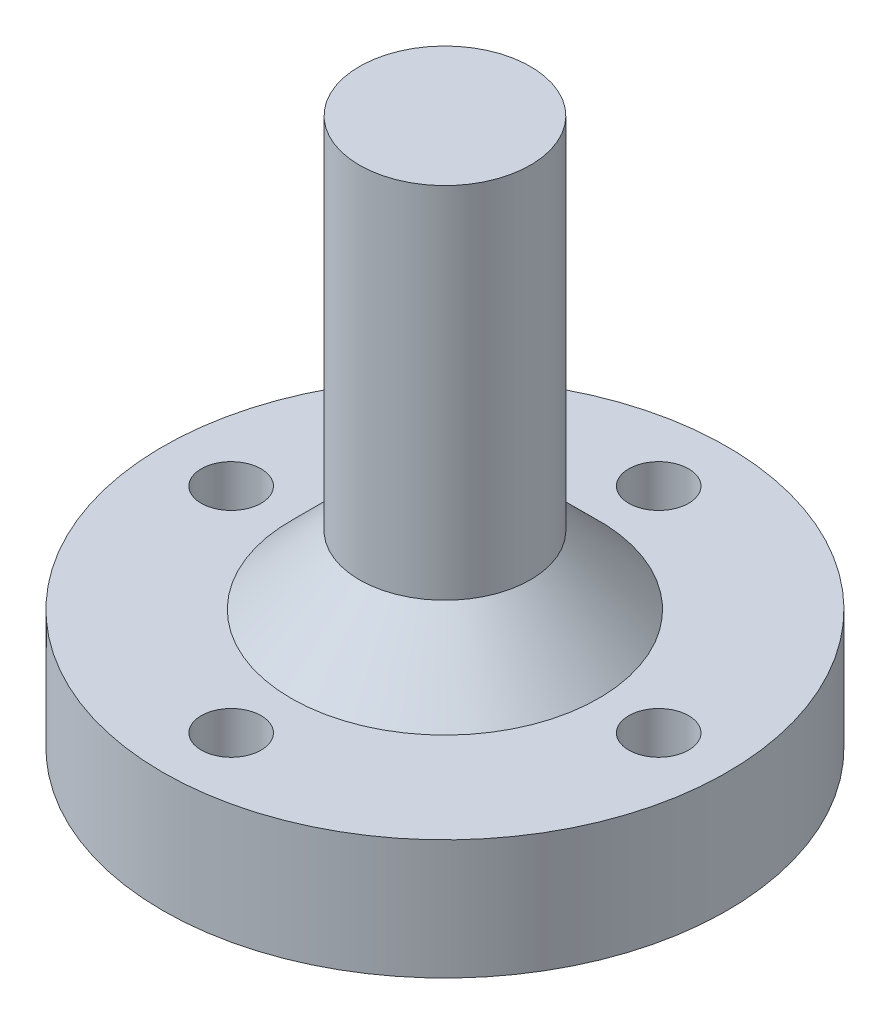
ISO-10303-21;
HEADER;
FILE_DESCRIPTION(('STEP AP214'),'2;1');
FILE_NAME('part.step','',(''),(''),'','','');
FILE_SCHEMA(('AUTOMOTIVE_DESIGN { 1 0 10303 214 1 1 1 1 }'));
ENDSEC;
DATA;
#1=APPLICATION_CONTEXT('core data for automotive mechanical design processes');
#2=APPLICATION_PROTOCOL_DEFINITION('international standard','automotive_design',2000,#1);
#3=PRODUCT_CONTEXT('',#1,'mechanical');
#4=PRODUCT('Part','Part','',(#3));
#5=PRODUCT_RELATED_PRODUCT_CATEGORY('part','',(#4));
#6=PRODUCT_DEFINITION_FORMATION('','',#4);
#7=PRODUCT_DEFINITION_CONTEXT('part definition',#1,'design');
#8=PRODUCT_DEFINITION('design','',#6,#7);
#9=PRODUCT_DEFINITION_SHAPE('','',#8);
#10=(LENGTH_UNIT() NAMED_UNIT(*) SI_UNIT(.MILLI.,.METRE.));
#11=(NAMED_UNIT(*) PLANE_ANGLE_UNIT() SI_UNIT($,.RADIAN.));
#12=(NAMED_UNIT(*) SI_UNIT($,.STERADIAN.) SOLID_ANGLE_UNIT());
#13=UNCERTAINTY_MEASURE_WITH_UNIT(LENGTH_MEASURE(1.E-05),#10,'distance_accuracy_value','');
#14=(GEOMETRIC_REPRESENTATION_CONTEXT(3) GLOBAL_UNCERTAINTY_ASSIGNED_CONTEXT((#13)) GLOBAL_UNIT_ASSIGNED_CONTEXT((#10,
#11,#12)) REPRESENTATION_CONTEXT('',''));
#15=CARTESIAN_POINT('',(0.,0.,0.));
#16=DIRECTION('',(0.,0.,1.));
#17=DIRECTION('',(1.,0.,0.));
#18=AXIS2_PLACEMENT_3D('',#15,#16,#17);
#19=CARTESIAN_POINT('',(0.,7.,0.));
#20=DIRECTION('',(0.,-1.,0.));
#21=DIRECTION('',(0.,0.,-1.));
#22=AXIS2_PLACEMENT_3D('',#19,#20,#21);
#23=CYLINDRICAL_SURFACE('',#22,16.5);
#24=CARTESIAN_POINT('',(0.,7.,0.));
#25=DIRECTION('',(0.,1.,0.));
#26=DIRECTION('',(0.,0.,1.));
#27=AXIS2_PLACEMENT_3D('',#24,#25,#26);
#28=CIRCLE('',#27,16.5);
#29=CARTESIAN_POINT('',(0.,7.,16.5));
#30=VERTEX_POINT('',#29);
#31=EDGE_CURVE('E50',#30,#30,#28,.T.);
#32=ORIENTED_EDGE('',*,*,#31,.F.);
#33=EDGE_LOOP('',(#32));
#34=FACE_BOUND('',#33,.T.);
#35=CARTESIAN_POINT('',(0.,0.,0.));
#36=DIRECTION('',(0.,1.,0.));
#37=DIRECTION('',(0.,0.,1.));
#38=AXIS2_PLACEMENT_3D('',#35,#36,#37);
#39=CIRCLE('',#38,16.5);
#40=CARTESIAN_POINT('',(0.,0.,16.5));
#41=VERTEX_POINT('',#40);
#42=EDGE_CURVE('E55',#41,#41,#39,.T.);
#43=ORIENTED_EDGE('',*,*,#42,.T.);
#44=EDGE_LOOP('',(#43));
#45=FACE_BOUND('',#44,.T.);
#46=ADVANCED_FACE('F37',(#34,#45),#23,.T.);
#47=CARTESIAN_POINT('',(0.,7.,0.));
#48=DIRECTION('',(0.,1.,0.));
#49=DIRECTION('',(0.,0.,1.));
#50=AXIS2_PLACEMENT_3D('',#47,#48,#49);
#51=PLANE('',#50);
#52=CARTESIAN_POINT('',(0.,7.,0.));
#53=DIRECTION('',(0.,1.,0.));
#54=DIRECTION('',(0.,0.,1.));
#55=AXIS2_PLACEMENT_3D('',#52,#53,#54);
#56=CIRCLE('',#55,8.99999999999999);
#57=CARTESIAN_POINT('',(0.,7.,8.99999999999999));
#58=VERTEX_POINT('',#57);
#59=EDGE_CURVE('E10',#58,#58,#56,.F.);
#60=ORIENTED_EDGE('',*,*,#59,.T.);
#61=EDGE_LOOP('',(#60));
#62=FACE_BOUND('',#61,.T.);
#63=CARTESIAN_POINT('',(-12.5,7.,0.));
#64=DIRECTION('',(0.,1.,0.));
#65=DIRECTION('',(1.,0.,0.));
#66=AXIS2_PLACEMENT_3D('',#63,#64,#65);
#67=CIRCLE('',#66,1.75);
#68=CARTESIAN_POINT('',(-10.75,7.,0.));
#69=VERTEX_POINT('',#68);
#70=EDGE_CURVE('E87',#69,#69,#67,.T.);
#71=ORIENTED_EDGE('',*,*,#70,.F.);
#72=EDGE_LOOP('',(#71));
#73=FACE_BOUND('',#72,.T.);
#74=CARTESIAN_POINT('',(0.,7.,12.5));
#75=DIRECTION('',(0.,1.,0.));
#76=DIRECTION('',(0.,0.,-1.));
#77=AXIS2_PLACEMENT_3D('',#74,#75,#76);
#78=CIRCLE('',#77,1.75);
#79=CARTESIAN_POINT('',(0.,7.,10.75));
#80=VERTEX_POINT('',#79);
#81=EDGE_CURVE('E79',#80,#80,#78,.T.);
#82=ORIENTED_EDGE('',*,*,#81,.F.);
#83=EDGE_LOOP('',(#82));
#84=FACE_BOUND('',#83,.T.);
#85=CARTESIAN_POINT('',(12.5,7.,-1.30930550206618E-13));
#86=DIRECTION('',(0.,1.,0.));
#87=DIRECTION('',(-1.,0.,0.));
#88=AXIS2_PLACEMENT_3D('',#85,#86,#87);
#89=CIRCLE('',#88,1.75);
#90=CARTESIAN_POINT('',(10.75,7.,-1.12600273177691E-13));
#91=VERTEX_POINT('',#90);
#92=EDGE_CURVE('E70',#91,#91,#89,.T.);
#93=ORIENTED_EDGE('',*,*,#92,.F.);
#94=EDGE_LOOP('',(#93));
#95=FACE_BOUND('',#94,.T.);
#96=CARTESIAN_POINT('',(0.,7.,-12.5));
#97=DIRECTION('',(0.,1.,0.));
#98=DIRECTION('',(0.,0.,1.));
#99=AXIS2_PLACEMENT_3D('',#96,#97,#98);
#100=CIRCLE('',#99,1.75);
#101=CARTESIAN_POINT('',(0.,7.,-10.75));
#102=VERTEX_POINT('',#101);
#103=EDGE_CURVE('E62',#102,#102,#100,.T.);
#104=ORIENTED_EDGE('',*,*,#103,.F.);
#105=EDGE_LOOP('',(#104));
#106=FACE_BOUND('',#105,.T.);
#107=ORIENTED_EDGE('',*,*,#31,.T.);
#108=EDGE_LOOP('',(#107));
#109=FACE_BOUND('',#108,.T.);
#110=ADVANCED_FACE('F138',(#62,#73,#84,#95,#106,#109),#51,.T.);
#111=CARTESIAN_POINT('',(0.,0.,0.));
#112=DIRECTION('',(0.,1.,0.));
#113=DIRECTION('',(0.,0.,1.));
#114=AXIS2_PLACEMENT_3D('',#111,#112,#113);
#115=PLANE('',#114);
#116=CARTESIAN_POINT('',(0.,0.,0.));
#117=DIRECTION('',(0.,-1.,0.));
#118=DIRECTION('',(0.,0.,-1.));
#119=AXIS2_PLACEMENT_3D('',#116,#117,#118);
#120=CIRCLE('',#119,5.25);
#121=CARTESIAN_POINT('',(0.,0.,-5.25));
#122=VERTEX_POINT('',#121);
#123=EDGE_CURVE('E98',#122,#122,#120,.T.);
#124=ORIENTED_EDGE('',*,*,#123,.F.);
#125=EDGE_LOOP('',(#124));
#126=FACE_BOUND('',#125,.T.);
#127=CARTESIAN_POINT('',(-12.5,0.,0.));
#128=DIRECTION('',(0.,1.,0.));
#129=DIRECTION('',(1.,0.,0.));
#130=AXIS2_PLACEMENT_3D('',#127,#128,#129);
#131=CIRCLE('',#130,1.75);
#132=CARTESIAN_POINT('',(-10.75,0.,0.));
#133=VERTEX_POINT('',#132);
#134=EDGE_CURVE('E66',#133,#133,#131,.T.);
#135=ORIENTED_EDGE('',*,*,#134,.T.);
#136=EDGE_LOOP('',(#135));
#137=FACE_BOUND('',#136,.T.);
#138=CARTESIAN_POINT('',(0.,0.,12.5));
#139=DIRECTION('',(0.,1.,0.));
#140=DIRECTION('',(0.,0.,-1.));
#141=AXIS2_PLACEMENT_3D('',#138,#139,#140);
#142=CIRCLE('',#141,1.75);
#143=CARTESIAN_POINT('',(0.,0.,10.75));
#144=VERTEX_POINT('',#143);
#145=EDGE_CURVE('E83',#144,#144,#142,.T.);
#146=ORIENTED_EDGE('',*,*,#145,.T.);
#147=EDGE_LOOP('',(#146));
#148=FACE_BOUND('',#147,.T.);
#149=CARTESIAN_POINT('',(12.5,0.,-1.30930550206618E-13));
#150=DIRECTION('',(0.,1.,0.));
#151=DIRECTION('',(-1.,0.,0.));
#152=AXIS2_PLACEMENT_3D('',#149,#150,#151);
#153=CIRCLE('',#152,1.75);
#154=CARTESIAN_POINT('',(10.75,0.,-1.12600273177691E-13));
#155=VERTEX_POINT('',#154);
#156=EDGE_CURVE('E74',#155,#155,#153,.T.);
#157=ORIENTED_EDGE('',*,*,#156,.T.);
#158=EDGE_LOOP('',(#157));
#159=FACE_BOUND('',#158,.T.);
#160=CARTESIAN_POINT('',(0.,0.,-12.5));
#161=DIRECTION('',(0.,1.,0.));
#162=DIRECTION('',(0.,0.,1.));
#163=AXIS2_PLACEMENT_3D('',#160,#161,#162);
#164=CIRCLE('',#163,1.75);
#165=CARTESIAN_POINT('',(0.,0.,-10.75));
#166=VERTEX_POINT('',#165);
#167=EDGE_CURVE('E60',#166,#166,#164,.T.);
#168=ORIENTED_EDGE('',*,*,#167,.T.);
#169=EDGE_LOOP('',(#168));
#170=FACE_BOUND('',#169,.T.);
#171=ORIENTED_EDGE('',*,*,#42,.F.);
#172=EDGE_LOOP('',(#171));
#173=FACE_BOUND('',#172,.T.);
#174=ADVANCED_FACE('F134',(#126,#137,#148,#159,#170,#173),#115,.F.);
#175=CARTESIAN_POINT('',(0.,0.,-12.5));
#176=DIRECTION('',(0.,1.,0.));
#177=DIRECTION('',(0.,0.,1.));
#178=AXIS2_PLACEMENT_3D('',#175,#176,#177);
#179=CYLINDRICAL_SURFACE('',#178,1.75);
#180=ORIENTED_EDGE('',*,*,#167,.F.);
#181=EDGE_LOOP('',(#180));
#182=FACE_BOUND('',#181,.T.);
#183=ORIENTED_EDGE('',*,*,#103,.T.);
#184=EDGE_LOOP('',(#183));
#185=FACE_BOUND('',#184,.T.);
#186=ADVANCED_FACE('F137',(#182,#185),#179,.F.);
#187=CARTESIAN_POINT('',(12.5,0.,-1.30930550206618E-13));
#188=DIRECTION('',(0.,1.,0.));
#189=DIRECTION('',(0.,0.,1.));
#190=AXIS2_PLACEMENT_3D('',#187,#188,#189);
#191=CYLINDRICAL_SURFACE('',#190,1.75);
#192=ORIENTED_EDGE('',*,*,#156,.F.);
#193=EDGE_LOOP('',(#192));
#194=FACE_BOUND('',#193,.T.);
#195=ORIENTED_EDGE('',*,*,#92,.T.);
#196=EDGE_LOOP('',(#195));
#197=FACE_BOUND('',#196,.T.);
#198=ADVANCED_FACE('F160',(#194,#197),#191,.F.);
#199=CARTESIAN_POINT('',(0.,0.,12.5));
#200=DIRECTION('',(0.,1.,0.));
#201=DIRECTION('',(0.,0.,1.));
#202=AXIS2_PLACEMENT_3D('',#199,#200,#201);
#203=CYLINDRICAL_SURFACE('',#202,1.75);
#204=ORIENTED_EDGE('',*,*,#145,.F.);
#205=EDGE_LOOP('',(#204));
#206=FACE_BOUND('',#205,.T.);
#207=ORIENTED_EDGE('',*,*,#81,.T.);
#208=EDGE_LOOP('',(#207));
#209=FACE_BOUND('',#208,.T.);
#210=ADVANCED_FACE('F164',(#206,#209),#203,.F.);
#211=CARTESIAN_POINT('',(-12.5,0.,0.));
#212=DIRECTION('',(0.,1.,0.));
#213=DIRECTION('',(0.,0.,1.));
#214=AXIS2_PLACEMENT_3D('',#211,#212,#213);
#215=CYLINDRICAL_SURFACE('',#214,1.75);
#216=ORIENTED_EDGE('',*,*,#134,.F.);
#217=EDGE_LOOP('',(#216));
#218=FACE_BOUND('',#217,.T.);
#219=ORIENTED_EDGE('',*,*,#70,.T.);
#220=EDGE_LOOP('',(#219));
#221=FACE_BOUND('',#220,.T.);
#222=ADVANCED_FACE('F168',(#218,#221),#215,.F.);
#223=CARTESIAN_POINT('',(0.,32.,0.));
#224=DIRECTION('',(0.,-1.,0.));
#225=DIRECTION('',(0.,0.,-1.));
#226=AXIS2_PLACEMENT_3D('',#223,#224,#225);
#227=CYLINDRICAL_SURFACE('',#226,5.);
#228=CARTESIAN_POINT('',(0.,11.,0.));
#229=DIRECTION('',(0.,1.,0.));
#230=DIRECTION('',(0.,0.,1.));
#231=AXIS2_PLACEMENT_3D('',#228,#229,#230);
#232=CIRCLE('',#231,5.);
#233=CARTESIAN_POINT('',(0.,11.,5.));
#234=VERTEX_POINT('',#233);
#235=EDGE_CURVE('E45',#234,#234,#232,.T.);
#236=ORIENTED_EDGE('',*,*,#235,.T.);
#237=EDGE_LOOP('',(#236));
#238=FACE_BOUND('',#237,.T.);
#239=CARTESIAN_POINT('',(0.,32.,0.));
#240=DIRECTION('',(0.,1.,0.));
#241=DIRECTION('',(0.,0.,1.));
#242=AXIS2_PLACEMENT_3D('',#239,#240,#241);
#243=CIRCLE('',#242,5.);
#244=CARTESIAN_POINT('',(0.,32.,5.));
#245=VERTEX_POINT('',#244);
#246=EDGE_CURVE('E75',#245,#245,#243,.T.);
#247=ORIENTED_EDGE('',*,*,#246,.F.);
#248=EDGE_LOOP('',(#247));
#249=FACE_BOUND('',#248,.T.);
#250=ADVANCED_FACE('F172',(#238,#249),#227,.T.);
#251=CARTESIAN_POINT('',(0.,32.,0.));
#252=DIRECTION('',(0.,1.,0.));
#253=DIRECTION('',(0.,0.,1.));
#254=AXIS2_PLACEMENT_3D('',#251,#252,#253);
#255=PLANE('',#254);
#256=ORIENTED_EDGE('',*,*,#246,.T.);
#257=EDGE_LOOP('',(#256));
#258=FACE_BOUND('',#257,.T.);
#259=ADVANCED_FACE('F176',(#258),#255,.T.);
#260=CARTESIAN_POINT('',(0.,11.,0.));
#261=DIRECTION('',(0.,-1.,0.));
#262=DIRECTION('',(0.,0.,-1.));
#263=AXIS2_PLACEMENT_3D('',#260,#261,#262);
#264=CONICAL_SURFACE('',#263,5.,0.785398163397444);
#265=ORIENTED_EDGE('',*,*,#59,.F.);
#266=EDGE_LOOP('',(#265));
#267=FACE_BOUND('',#266,.T.);
#268=ORIENTED_EDGE('',*,*,#235,.F.);
#269=EDGE_LOOP('',(#268));
#270=FACE_BOUND('',#269,.T.);
#271=ADVANCED_FACE('F39',(#267,#270),#264,.T.);
#272=CARTESIAN_POINT('',(0.,5.5,0.));
#273=DIRECTION('',(0.,-1.,0.));
#274=DIRECTION('',(0.,0.,-1.));
#275=AXIS2_PLACEMENT_3D('',#272,#273,#274);
#276=CYLINDRICAL_SURFACE('',#275,5.25);
#277=CARTESIAN_POINT('',(0.,5.5,0.));
#278=DIRECTION('',(0.,-1.,0.));
#279=DIRECTION('',(0.,0.,-1.));
#280=AXIS2_PLACEMENT_3D('',#277,#278,#279);
#281=CIRCLE('',#280,5.25);
#282=CARTESIAN_POINT('',(0.,5.5,-5.25));
#283=VERTEX_POINT('',#282);
#284=EDGE_CURVE('E97',#283,#283,#281,.T.);
#285=ORIENTED_EDGE('',*,*,#284,.F.);
#286=EDGE_LOOP('',(#285));
#287=FACE_BOUND('',#286,.T.);
#288=ORIENTED_EDGE('',*,*,#123,.T.);
#289=EDGE_LOOP('',(#288));
#290=FACE_BOUND('',#289,.T.);
#291=ADVANCED_FACE('F125',(#287,#290),#276,.F.);
#292=CARTESIAN_POINT('',(0.,5.5,0.));
#293=DIRECTION('',(0.,-1.,0.));
#294=DIRECTION('',(0.,0.,-1.));
#295=AXIS2_PLACEMENT_3D('',#292,#293,#294);
#296=PLANE('',#295);
#297=CARTESIAN_POINT('',(0.,5.5,0.));
#298=DIRECTION('',(0.,-1.,0.));
#299=DIRECTION('',(0.,0.,-1.));
#300=AXIS2_PLACEMENT_3D('',#297,#298,#299);
#301=CIRCLE('',#300,2.75);
#302=CARTESIAN_POINT('',(0.,5.5,-2.75));
#303=VERTEX_POINT('',#302);
#304=EDGE_CURVE('E106',#303,#303,#301,.T.);
#305=ORIENTED_EDGE('',*,*,#304,.F.);
#306=EDGE_LOOP('',(#305));
#307=FACE_BOUND('',#306,.T.);
#308=ORIENTED_EDGE('',*,*,#284,.T.);
#309=EDGE_LOOP('',(#308));
#310=FACE_BOUND('',#309,.T.);
#311=ADVANCED_FACE('F119',(#307,#310),#296,.T.);
#312=CARTESIAN_POINT('',(0.,11.5,0.));
#313=DIRECTION('',(0.,-1.,0.));
#314=DIRECTION('',(0.,0.,-1.));
#315=AXIS2_PLACEMENT_3D('',#312,#313,#314);
#316=CYLINDRICAL_SURFACE('',#315,2.75);
#317=CARTESIAN_POINT('',(0.,11.5,0.));
#318=DIRECTION('',(0.,-1.,0.));
#319=DIRECTION('',(0.,0.,-1.));
#320=AXIS2_PLACEMENT_3D('',#317,#318,#319);
#321=CIRCLE('',#320,2.75);
#322=CARTESIAN_POINT('',(0.,11.5,-2.75));
#323=VERTEX_POINT('',#322);
#324=EDGE_CURVE('E102',#323,#323,#321,.T.);
#325=ORIENTED_EDGE('',*,*,#324,.F.);
#326=EDGE_LOOP('',(#325));
#327=FACE_BOUND('',#326,.T.);
#328=ORIENTED_EDGE('',*,*,#304,.T.);
#329=EDGE_LOOP('',(#328));
#330=FACE_BOUND('',#329,.T.);
#331=ADVANCED_FACE('F116',(#327,#330),#316,.F.);
#332=CARTESIAN_POINT('',(0.,11.5,0.));
#333=DIRECTION('',(0.,-1.,0.));
#334=DIRECTION('',(0.,0.,-1.));
#335=AXIS2_PLACEMENT_3D('',#332,#333,#334);
#336=PLANE('',#335);
#337=ORIENTED_EDGE('',*,*,#324,.T.);
#338=EDGE_LOOP('',(#337));
#339=FACE_BOUND('',#338,.T.);
#340=ADVANCED_FACE('F114',(#339),#336,.T.);
#341=CLOSED_SHELL('',(#46,#110,#174,#186,#198,#210,#222,#250,#259,#271,#291,#311,#331,#340));
#342=MANIFOLD_SOLID_BREP('B2',#341);
#343=ADVANCED_BREP_SHAPE_REPRESENTATION('',(#18,#342),#14);
#344=SHAPE_DEFINITION_REPRESENTATION(#9,#343);
ENDSEC;
END-ISO-10303-21;
